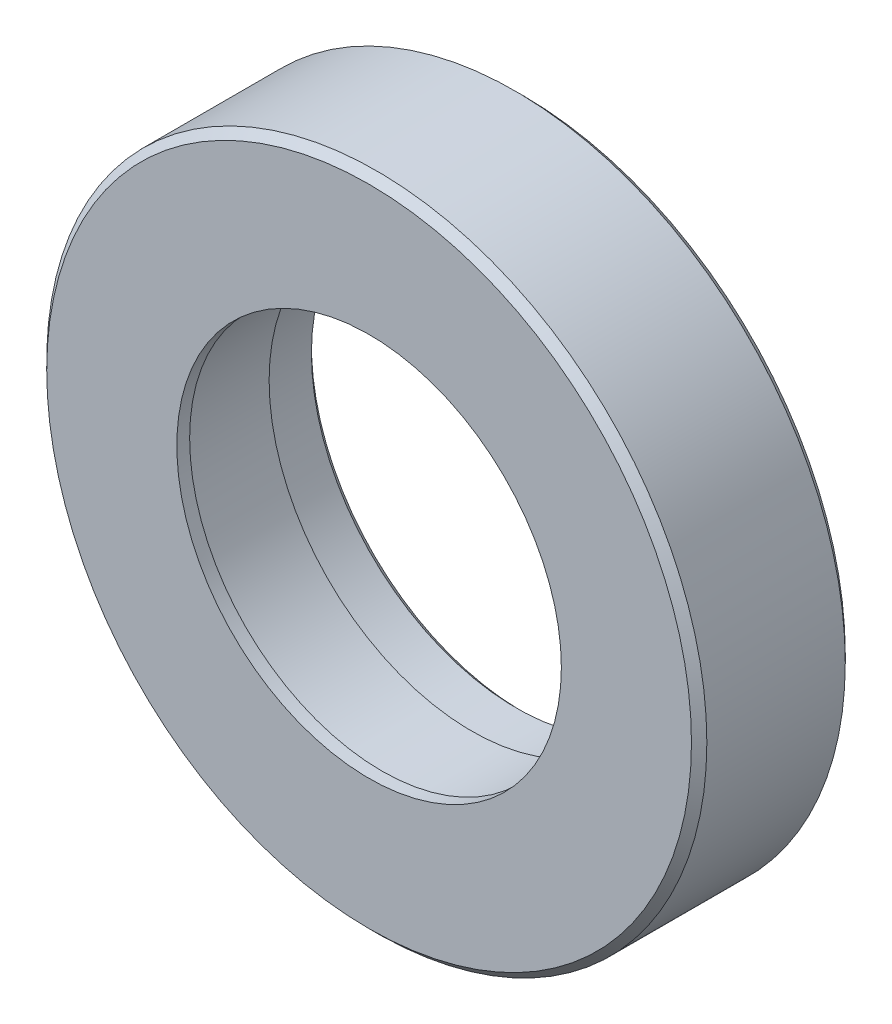
ISO-10303-21;
HEADER;
FILE_DESCRIPTION(('STEP AP214'),'2;1');
FILE_NAME('part.step','',(''),(''),'','','');
FILE_SCHEMA(('AUTOMOTIVE_DESIGN { 1 0 10303 214 1 1 1 1 }'));
ENDSEC;
DATA;
#1=APPLICATION_CONTEXT('core data for automotive mechanical design processes');
#2=APPLICATION_PROTOCOL_DEFINITION('international standard','automotive_design',2000,#1);
#3=PRODUCT_CONTEXT('',#1,'mechanical');
#4=PRODUCT('Part','Part','',(#3));
#5=PRODUCT_RELATED_PRODUCT_CATEGORY('part','',(#4));
#6=PRODUCT_DEFINITION_FORMATION('','',#4);
#7=PRODUCT_DEFINITION_CONTEXT('part definition',#1,'design');
#8=PRODUCT_DEFINITION('design','',#6,#7);
#9=PRODUCT_DEFINITION_SHAPE('','',#8);
#10=(LENGTH_UNIT() NAMED_UNIT(*) SI_UNIT(.MILLI.,.METRE.));
#11=(NAMED_UNIT(*) PLANE_ANGLE_UNIT() SI_UNIT($,.RADIAN.));
#12=(NAMED_UNIT(*) SI_UNIT($,.STERADIAN.) SOLID_ANGLE_UNIT());
#13=UNCERTAINTY_MEASURE_WITH_UNIT(LENGTH_MEASURE(1.E-05),#10,'distance_accuracy_value','');
#14=(GEOMETRIC_REPRESENTATION_CONTEXT(3) GLOBAL_UNCERTAINTY_ASSIGNED_CONTEXT((#13)) GLOBAL_UNIT_ASSIGNED_CONTEXT((#10,
#11,#12)) REPRESENTATION_CONTEXT('',''));
#15=CARTESIAN_POINT('',(0.,0.,0.));
#16=DIRECTION('',(0.,0.,1.));
#17=DIRECTION('',(1.,0.,0.));
#18=AXIS2_PLACEMENT_3D('',#15,#16,#17);
#19=CARTESIAN_POINT('',(0.,0.,11.));
#20=DIRECTION('',(0.,0.,-1.));
#21=DIRECTION('',(-1.,0.,0.));
#22=AXIS2_PLACEMENT_3D('',#19,#20,#21);
#23=CYLINDRICAL_SURFACE('',#22,15.8);
#24=CARTESIAN_POINT('',(0.,0.,11.));
#25=DIRECTION('',(0.,0.,-1.));
#26=DIRECTION('',(-1.,0.,0.));
#27=AXIS2_PLACEMENT_3D('',#24,#25,#26);
#28=CIRCLE('',#27,15.8);
#29=CARTESIAN_POINT('',(-15.8,0.,11.));
#30=VERTEX_POINT('',#29);
#31=EDGE_CURVE('E51',#30,#30,#28,.T.);
#32=ORIENTED_EDGE('',*,*,#31,.F.);
#33=EDGE_LOOP('',(#32));
#34=FACE_BOUND('',#33,.T.);
#35=CARTESIAN_POINT('',(0.,0.,4.));
#36=DIRECTION('',(0.,0.,-1.));
#37=DIRECTION('',(-1.,0.,0.));
#38=AXIS2_PLACEMENT_3D('',#35,#36,#37);
#39=CIRCLE('',#38,15.8);
#40=CARTESIAN_POINT('',(-15.8,0.,4.));
#41=VERTEX_POINT('',#40);
#42=EDGE_CURVE('E48',#41,#41,#39,.F.);
#43=ORIENTED_EDGE('',*,*,#42,.F.);
#44=EDGE_LOOP('',(#43));
#45=FACE_BOUND('',#44,.T.);
#46=ADVANCED_FACE('F30',(#34,#45),#23,.F.);
#47=CARTESIAN_POINT('',(0.,0.,0.));
#48=DIRECTION('',(0.,0.,1.));
#49=DIRECTION('',(1.,0.,0.));
#50=AXIS2_PLACEMENT_3D('',#47,#48,#49);
#51=CYLINDRICAL_SURFACE('',#50,15.);
#52=CARTESIAN_POINT('',(0.,0.,12.));
#53=DIRECTION('',(0.,0.,1.));
#54=DIRECTION('',(1.,0.,0.));
#55=AXIS2_PLACEMENT_3D('',#52,#53,#54);
#56=CIRCLE('',#55,15.);
#57=CARTESIAN_POINT('',(15.,0.,12.));
#58=VERTEX_POINT('',#57);
#59=EDGE_CURVE('E55',#58,#58,#56,.T.);
#60=ORIENTED_EDGE('',*,*,#59,.T.);
#61=EDGE_LOOP('',(#60));
#62=FACE_BOUND('',#61,.T.);
#63=CARTESIAN_POINT('',(0.,0.,11.));
#64=DIRECTION('',(0.,0.,-1.));
#65=DIRECTION('',(-1.,0.,0.));
#66=AXIS2_PLACEMENT_3D('',#63,#64,#65);
#67=CIRCLE('',#66,15.);
#68=CARTESIAN_POINT('',(-15.,0.,11.));
#69=VERTEX_POINT('',#68);
#70=EDGE_CURVE('E53',#69,#69,#67,.F.);
#71=ORIENTED_EDGE('',*,*,#70,.F.);
#72=EDGE_LOOP('',(#71));
#73=FACE_BOUND('',#72,.T.);
#74=ADVANCED_FACE('F87',(#62,#73),#51,.F.);
#75=CARTESIAN_POINT('',(0.,0.,12.));
#76=DIRECTION('',(0.,0.,-1.));
#77=DIRECTION('',(-1.,0.,0.));
#78=AXIS2_PLACEMENT_3D('',#75,#76,#77);
#79=CYLINDRICAL_SURFACE('',#78,25.75);
#80=CARTESIAN_POINT('',(0.,0.,0.600000000000007));
#81=DIRECTION('',(0.,0.,1.));
#82=DIRECTION('',(1.,0.,0.));
#83=AXIS2_PLACEMENT_3D('',#80,#81,#82);
#84=CIRCLE('',#83,25.75);
#85=CARTESIAN_POINT('',(25.75,0.,0.600000000000007));
#86=VERTEX_POINT('',#85);
#87=EDGE_CURVE('E59',#86,#86,#84,.T.);
#88=ORIENTED_EDGE('',*,*,#87,.T.);
#89=EDGE_LOOP('',(#88));
#90=FACE_BOUND('',#89,.T.);
#91=CARTESIAN_POINT('',(0.,0.,11.4));
#92=DIRECTION('',(0.,0.,1.));
#93=DIRECTION('',(1.,0.,0.));
#94=AXIS2_PLACEMENT_3D('',#91,#92,#93);
#95=CIRCLE('',#94,25.75);
#96=CARTESIAN_POINT('',(25.75,0.,11.4));
#97=VERTEX_POINT('',#96);
#98=EDGE_CURVE('E62',#97,#97,#95,.F.);
#99=ORIENTED_EDGE('',*,*,#98,.T.);
#100=EDGE_LOOP('',(#99));
#101=FACE_BOUND('',#100,.T.);
#102=ADVANCED_FACE('F93',(#90,#101),#79,.T.);
#103=CARTESIAN_POINT('',(0.,0.,12.));
#104=DIRECTION('',(0.,0.,1.));
#105=DIRECTION('',(1.,0.,0.));
#106=AXIS2_PLACEMENT_3D('',#103,#104,#105);
#107=PLANE('',#106);
#108=ORIENTED_EDGE('',*,*,#59,.F.);
#109=EDGE_LOOP('',(#108));
#110=FACE_BOUND('',#109,.T.);
#111=CARTESIAN_POINT('',(0.,0.,12.));
#112=DIRECTION('',(0.,0.,1.));
#113=DIRECTION('',(1.,0.,0.));
#114=AXIS2_PLACEMENT_3D('',#111,#112,#113);
#115=CIRCLE('',#114,25.15);
#116=CARTESIAN_POINT('',(25.15,0.,12.));
#117=VERTEX_POINT('',#116);
#118=EDGE_CURVE('E41',#117,#117,#115,.T.);
#119=ORIENTED_EDGE('',*,*,#118,.T.);
#120=EDGE_LOOP('',(#119));
#121=FACE_BOUND('',#120,.T.);
#122=ADVANCED_FACE('F99',(#110,#121),#107,.T.);
#123=CARTESIAN_POINT('',(0.,0.,0.));
#124=DIRECTION('',(0.,0.,1.));
#125=DIRECTION('',(1.,0.,0.));
#126=AXIS2_PLACEMENT_3D('',#123,#124,#125);
#127=PLANE('',#126);
#128=CARTESIAN_POINT('',(0.,0.,0.));
#129=DIRECTION('',(0.,0.,1.));
#130=DIRECTION('',(1.,0.,0.));
#131=AXIS2_PLACEMENT_3D('',#128,#129,#130);
#132=CIRCLE('',#131,16.5);
#133=CARTESIAN_POINT('',(16.5,0.,0.));
#134=VERTEX_POINT('',#133);
#135=EDGE_CURVE('E10',#134,#134,#132,.T.);
#136=ORIENTED_EDGE('',*,*,#135,.T.);
#137=EDGE_LOOP('',(#136));
#138=FACE_BOUND('',#137,.T.);
#139=CARTESIAN_POINT('',(0.,0.,0.));
#140=DIRECTION('',(0.,0.,1.));
#141=DIRECTION('',(1.,0.,0.));
#142=AXIS2_PLACEMENT_3D('',#139,#140,#141);
#143=CIRCLE('',#142,25.15);
#144=CARTESIAN_POINT('',(25.15,0.,0.));
#145=VERTEX_POINT('',#144);
#146=EDGE_CURVE('E45',#145,#145,#143,.F.);
#147=ORIENTED_EDGE('',*,*,#146,.T.);
#148=EDGE_LOOP('',(#147));
#149=FACE_BOUND('',#148,.T.);
#150=ADVANCED_FACE('F102',(#138,#149),#127,.F.);
#151=CARTESIAN_POINT('',(0.,0.,0.600000000000007));
#152=DIRECTION('',(0.,0.,1.));
#153=DIRECTION('',(1.,0.,0.));
#154=AXIS2_PLACEMENT_3D('',#151,#152,#153);
#155=CONICAL_SURFACE('',#154,25.75,0.785398163397451);
#156=ORIENTED_EDGE('',*,*,#146,.F.);
#157=EDGE_LOOP('',(#156));
#158=FACE_BOUND('',#157,.T.);
#159=ORIENTED_EDGE('',*,*,#87,.F.);
#160=EDGE_LOOP('',(#159));
#161=FACE_BOUND('',#160,.T.);
#162=ADVANCED_FACE('F106',(#158,#161),#155,.T.);
#163=CARTESIAN_POINT('',(0.,0.,12.));
#164=DIRECTION('',(0.,0.,-1.));
#165=DIRECTION('',(-1.,0.,0.));
#166=AXIS2_PLACEMENT_3D('',#163,#164,#165);
#167=CONICAL_SURFACE('',#166,25.15,0.785398163397448);
#168=ORIENTED_EDGE('',*,*,#98,.F.);
#169=EDGE_LOOP('',(#168));
#170=FACE_BOUND('',#169,.T.);
#171=ORIENTED_EDGE('',*,*,#118,.F.);
#172=EDGE_LOOP('',(#171));
#173=FACE_BOUND('',#172,.T.);
#174=ADVANCED_FACE('F111',(#170,#173),#167,.T.);
#175=CARTESIAN_POINT('',(0.,0.,11.));
#176=DIRECTION('',(0.,0.,-1.));
#177=DIRECTION('',(-1.,0.,0.));
#178=AXIS2_PLACEMENT_3D('',#175,#176,#177);
#179=PLANE('',#178);
#180=ORIENTED_EDGE('',*,*,#31,.T.);
#181=EDGE_LOOP('',(#180));
#182=FACE_BOUND('',#181,.T.);
#183=ORIENTED_EDGE('',*,*,#70,.T.);
#184=EDGE_LOOP('',(#183));
#185=FACE_BOUND('',#184,.T.);
#186=ADVANCED_FACE('F83',(#182,#185),#179,.T.);
#187=CARTESIAN_POINT('',(0.,0.,4.));
#188=DIRECTION('',(0.,0.,-1.));
#189=DIRECTION('',(-1.,0.,0.));
#190=AXIS2_PLACEMENT_3D('',#187,#188,#189);
#191=PLANE('',#190);
#192=CARTESIAN_POINT('',(0.,0.,4.));
#193=DIRECTION('',(0.,0.,-1.));
#194=DIRECTION('',(-1.,0.,0.));
#195=AXIS2_PLACEMENT_3D('',#192,#193,#194);
#196=CIRCLE('',#195,16.);
#197=CARTESIAN_POINT('',(-16.,0.,4.));
#198=VERTEX_POINT('',#197);
#199=EDGE_CURVE('E52',#198,#198,#196,.T.);
#200=ORIENTED_EDGE('',*,*,#199,.T.);
#201=EDGE_LOOP('',(#200));
#202=FACE_BOUND('',#201,.T.);
#203=ORIENTED_EDGE('',*,*,#42,.T.);
#204=EDGE_LOOP('',(#203));
#205=FACE_BOUND('',#204,.T.);
#206=ADVANCED_FACE('F72',(#202,#205),#191,.T.);
#207=CARTESIAN_POINT('',(0.,0.,4.));
#208=DIRECTION('',(0.,0.,-1.));
#209=DIRECTION('',(-1.,0.,0.));
#210=AXIS2_PLACEMENT_3D('',#207,#208,#209);
#211=CYLINDRICAL_SURFACE('',#210,16.);
#212=CARTESIAN_POINT('',(0.,0.,0.500000000000014));
#213=DIRECTION('',(0.,0.,1.));
#214=DIRECTION('',(1.,0.,0.));
#215=AXIS2_PLACEMENT_3D('',#212,#213,#214);
#216=CIRCLE('',#215,16.);
#217=CARTESIAN_POINT('',(16.,0.,0.500000000000014));
#218=VERTEX_POINT('',#217);
#219=EDGE_CURVE('E37',#218,#218,#216,.F.);
#220=ORIENTED_EDGE('',*,*,#219,.T.);
#221=EDGE_LOOP('',(#220));
#222=FACE_BOUND('',#221,.T.);
#223=ORIENTED_EDGE('',*,*,#199,.F.);
#224=EDGE_LOOP('',(#223));
#225=FACE_BOUND('',#224,.T.);
#226=ADVANCED_FACE('F75',(#222,#225),#211,.F.);
#227=CARTESIAN_POINT('',(0.,0.,0.500000000000014));
#228=DIRECTION('',(0.,0.,-1.));
#229=DIRECTION('',(-1.,0.,0.));
#230=AXIS2_PLACEMENT_3D('',#227,#228,#229);
#231=CONICAL_SURFACE('',#230,16.,0.785398163397448);
#232=ORIENTED_EDGE('',*,*,#135,.F.);
#233=EDGE_LOOP('',(#232));
#234=FACE_BOUND('',#233,.T.);
#235=ORIENTED_EDGE('',*,*,#219,.F.);
#236=EDGE_LOOP('',(#235));
#237=FACE_BOUND('',#236,.T.);
#238=ADVANCED_FACE('F32',(#234,#237),#231,.F.);
#239=CLOSED_SHELL('',(#46,#74,#102,#122,#150,#162,#174,#186,#206,#226,#238));
#240=MANIFOLD_SOLID_BREP('B2',#239);
#241=ADVANCED_BREP_SHAPE_REPRESENTATION('',(#18,#240),#14);
#242=SHAPE_DEFINITION_REPRESENTATION(#9,#241);
ENDSEC;
END-ISO-10303-21;
